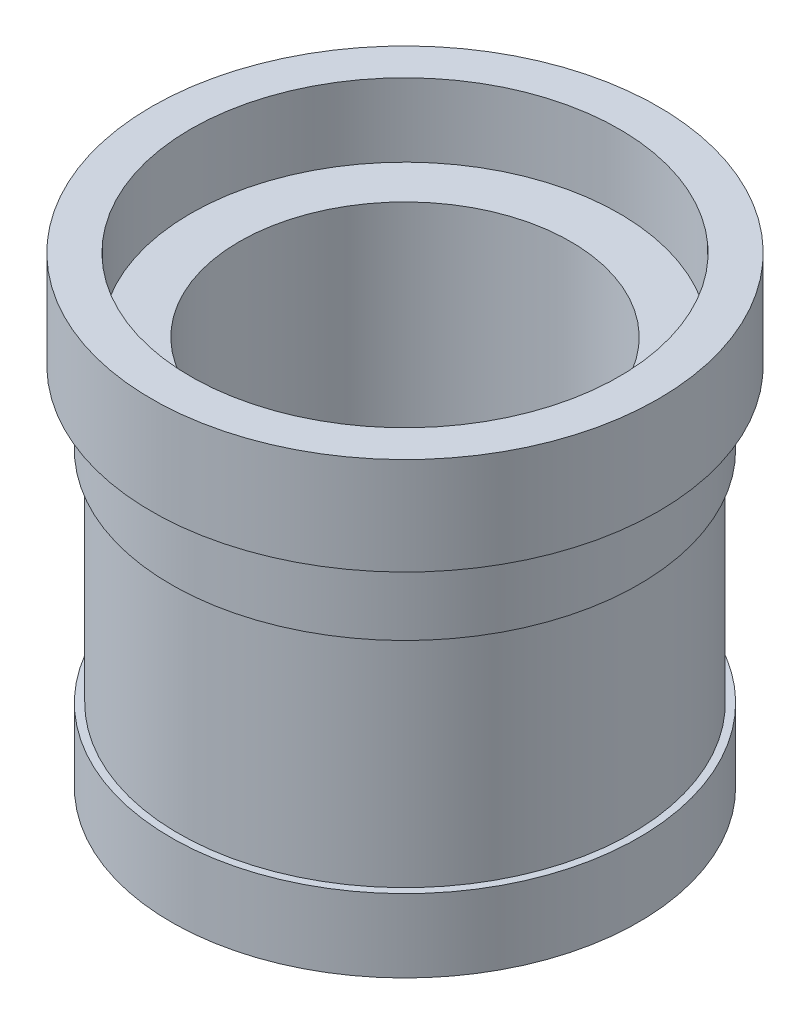
ISO-10303-21;
HEADER;
FILE_DESCRIPTION(('STEP AP214'),'2;1');
FILE_NAME('part.step','',(''),(''),'','','');
FILE_SCHEMA(('AUTOMOTIVE_DESIGN { 1 0 10303 214 1 1 1 1 }'));
ENDSEC;
DATA;
#1=APPLICATION_CONTEXT('core data for automotive mechanical design processes');
#2=APPLICATION_PROTOCOL_DEFINITION('international standard','automotive_design',2000,#1);
#3=PRODUCT_CONTEXT('',#1,'mechanical');
#4=PRODUCT('Part','Part','',(#3));
#5=PRODUCT_RELATED_PRODUCT_CATEGORY('part','',(#4));
#6=PRODUCT_DEFINITION_FORMATION('','',#4);
#7=PRODUCT_DEFINITION_CONTEXT('part definition',#1,'design');
#8=PRODUCT_DEFINITION('design','',#6,#7);
#9=PRODUCT_DEFINITION_SHAPE('','',#8);
#10=(LENGTH_UNIT() NAMED_UNIT(*) SI_UNIT(.MILLI.,.METRE.));
#11=(NAMED_UNIT(*) PLANE_ANGLE_UNIT() SI_UNIT($,.RADIAN.));
#12=(NAMED_UNIT(*) SI_UNIT($,.STERADIAN.) SOLID_ANGLE_UNIT());
#13=UNCERTAINTY_MEASURE_WITH_UNIT(LENGTH_MEASURE(1.E-05),#10,'distance_accuracy_value','');
#14=(GEOMETRIC_REPRESENTATION_CONTEXT(3) GLOBAL_UNCERTAINTY_ASSIGNED_CONTEXT((#13)) GLOBAL_UNIT_ASSIGNED_CONTEXT((#10,
#11,#12)) REPRESENTATION_CONTEXT('',''));
#15=CARTESIAN_POINT('',(0.,0.,0.));
#16=DIRECTION('',(0.,0.,1.));
#17=DIRECTION('',(1.,0.,0.));
#18=AXIS2_PLACEMENT_3D('',#15,#16,#17);
#19=CARTESIAN_POINT('',(0.,74.8007416282434,0.));
#20=DIRECTION('',(0.,1.,0.));
#21=DIRECTION('',(-1.,0.,0.));
#22=AXIS2_PLACEMENT_3D('',#19,#20,#21);
#23=CYLINDRICAL_SURFACE('',#22,34.);
#24=CARTESIAN_POINT('',(0.,0.,0.));
#25=DIRECTION('',(0.,1.,0.));
#26=DIRECTION('',(-1.,0.,0.));
#27=AXIS2_PLACEMENT_3D('',#24,#25,#26);
#28=CIRCLE('',#27,34.);
#29=CARTESIAN_POINT('',(-34.,0.,0.));
#30=VERTEX_POINT('',#29);
#31=EDGE_CURVE('E10',#30,#30,#28,.T.);
#32=ORIENTED_EDGE('',*,*,#31,.F.);
#33=EDGE_LOOP('',(#32));
#34=FACE_BOUND('',#33,.T.);
#35=CARTESIAN_POINT('',(0.,80.,0.));
#36=DIRECTION('',(0.,1.,0.));
#37=DIRECTION('',(-1.,0.,0.));
#38=AXIS2_PLACEMENT_3D('',#35,#36,#37);
#39=CIRCLE('',#38,34.);
#40=CARTESIAN_POINT('',(-34.,80.,0.));
#41=VERTEX_POINT('',#40);
#42=EDGE_CURVE('E88',#41,#41,#39,.T.);
#43=ORIENTED_EDGE('',*,*,#42,.T.);
#44=EDGE_LOOP('',(#43));
#45=FACE_BOUND('',#44,.T.);
#46=ADVANCED_FACE('F37',(#34,#45),#23,.F.);
#47=CARTESIAN_POINT('',(34.,0.,0.));
#48=DIRECTION('',(0.,1.,0.));
#49=DIRECTION('',(-1.,0.,0.));
#50=AXIS2_PLACEMENT_3D('',#47,#48,#49);
#51=PLANE('',#50);
#52=CARTESIAN_POINT('',(0.,0.,0.));
#53=DIRECTION('',(0.,1.,0.));
#54=DIRECTION('',(-1.,0.,0.));
#55=AXIS2_PLACEMENT_3D('',#52,#53,#54);
#56=CIRCLE('',#55,48.);
#57=CARTESIAN_POINT('',(-48.,0.,0.));
#58=VERTEX_POINT('',#57);
#59=EDGE_CURVE('E44',#58,#58,#56,.T.);
#60=ORIENTED_EDGE('',*,*,#59,.F.);
#61=EDGE_LOOP('',(#60));
#62=FACE_BOUND('',#61,.T.);
#63=ORIENTED_EDGE('',*,*,#31,.T.);
#64=EDGE_LOOP('',(#63));
#65=FACE_BOUND('',#64,.T.);
#66=ADVANCED_FACE('F150',(#62,#65),#51,.F.);
#67=CARTESIAN_POINT('',(0.,74.8007416282434,0.));
#68=DIRECTION('',(0.,1.,0.));
#69=DIRECTION('',(-1.,0.,0.));
#70=AXIS2_PLACEMENT_3D('',#67,#68,#69);
#71=CYLINDRICAL_SURFACE('',#70,48.);
#72=CARTESIAN_POINT('',(0.,15.,0.));
#73=DIRECTION('',(0.,1.,0.));
#74=DIRECTION('',(-1.,0.,0.));
#75=AXIS2_PLACEMENT_3D('',#72,#73,#74);
#76=CIRCLE('',#75,48.);
#77=CARTESIAN_POINT('',(-48.,15.,0.));
#78=VERTEX_POINT('',#77);
#79=EDGE_CURVE('E49',#78,#78,#76,.T.);
#80=ORIENTED_EDGE('',*,*,#79,.F.);
#81=EDGE_LOOP('',(#80));
#82=FACE_BOUND('',#81,.T.);
#83=ORIENTED_EDGE('',*,*,#59,.T.);
#84=EDGE_LOOP('',(#83));
#85=FACE_BOUND('',#84,.T.);
#86=ADVANCED_FACE('F145',(#82,#85),#71,.T.);
#87=CARTESIAN_POINT('',(48.,15.,0.));
#88=DIRECTION('',(0.,-1.,0.));
#89=DIRECTION('',(1.,0.,0.));
#90=AXIS2_PLACEMENT_3D('',#87,#88,#89);
#91=PLANE('',#90);
#92=CARTESIAN_POINT('',(0.,15.,0.));
#93=DIRECTION('',(0.,1.,0.));
#94=DIRECTION('',(-1.,0.,0.));
#95=AXIS2_PLACEMENT_3D('',#92,#93,#94);
#96=CIRCLE('',#95,46.5);
#97=CARTESIAN_POINT('',(-46.5,15.,0.));
#98=VERTEX_POINT('',#97);
#99=EDGE_CURVE('E54',#98,#98,#96,.T.);
#100=ORIENTED_EDGE('',*,*,#99,.F.);
#101=EDGE_LOOP('',(#100));
#102=FACE_BOUND('',#101,.T.);
#103=ORIENTED_EDGE('',*,*,#79,.T.);
#104=EDGE_LOOP('',(#103));
#105=FACE_BOUND('',#104,.T.);
#106=ADVANCED_FACE('F139',(#102,#105),#91,.F.);
#107=CARTESIAN_POINT('',(0.,74.8007416282434,0.));
#108=DIRECTION('',(0.,1.,0.));
#109=DIRECTION('',(-1.,0.,0.));
#110=AXIS2_PLACEMENT_3D('',#107,#108,#109);
#111=CYLINDRICAL_SURFACE('',#110,46.5);
#112=CARTESIAN_POINT('',(0.,60.,0.));
#113=DIRECTION('',(0.,1.,0.));
#114=DIRECTION('',(-1.,0.,0.));
#115=AXIS2_PLACEMENT_3D('',#112,#113,#114);
#116=CIRCLE('',#115,46.5);
#117=CARTESIAN_POINT('',(-46.5,60.,0.));
#118=VERTEX_POINT('',#117);
#119=EDGE_CURVE('E60',#118,#118,#116,.T.);
#120=ORIENTED_EDGE('',*,*,#119,.F.);
#121=EDGE_LOOP('',(#120));
#122=FACE_BOUND('',#121,.T.);
#123=ORIENTED_EDGE('',*,*,#99,.T.);
#124=EDGE_LOOP('',(#123));
#125=FACE_BOUND('',#124,.T.);
#126=ADVANCED_FACE('F133',(#122,#125),#111,.T.);
#127=CARTESIAN_POINT('',(46.5,60.,0.));
#128=DIRECTION('',(0.,1.,0.));
#129=DIRECTION('',(-1.,0.,0.));
#130=AXIS2_PLACEMENT_3D('',#127,#128,#129);
#131=PLANE('',#130);
#132=CARTESIAN_POINT('',(0.,60.,0.));
#133=DIRECTION('',(0.,1.,0.));
#134=DIRECTION('',(-1.,0.,0.));
#135=AXIS2_PLACEMENT_3D('',#132,#133,#134);
#136=CIRCLE('',#135,48.);
#137=CARTESIAN_POINT('',(-48.,60.,0.));
#138=VERTEX_POINT('',#137);
#139=EDGE_CURVE('E64',#138,#138,#136,.T.);
#140=ORIENTED_EDGE('',*,*,#139,.F.);
#141=EDGE_LOOP('',(#140));
#142=FACE_BOUND('',#141,.T.);
#143=ORIENTED_EDGE('',*,*,#119,.T.);
#144=EDGE_LOOP('',(#143));
#145=FACE_BOUND('',#144,.T.);
#146=ADVANCED_FACE('F127',(#142,#145),#131,.F.);
#147=CARTESIAN_POINT('',(0.,74.8007416282434,0.));
#148=DIRECTION('',(0.,1.,0.));
#149=DIRECTION('',(-1.,0.,0.));
#150=AXIS2_PLACEMENT_3D('',#147,#148,#149);
#151=CYLINDRICAL_SURFACE('',#150,48.);
#152=CARTESIAN_POINT('',(0.,75.,0.));
#153=DIRECTION('',(0.,1.,0.));
#154=DIRECTION('',(-1.,0.,0.));
#155=AXIS2_PLACEMENT_3D('',#152,#153,#154);
#156=CIRCLE('',#155,48.);
#157=CARTESIAN_POINT('',(-48.,75.,0.));
#158=VERTEX_POINT('',#157);
#159=EDGE_CURVE('E68',#158,#158,#156,.T.);
#160=ORIENTED_EDGE('',*,*,#159,.F.);
#161=EDGE_LOOP('',(#160));
#162=FACE_BOUND('',#161,.T.);
#163=ORIENTED_EDGE('',*,*,#139,.T.);
#164=EDGE_LOOP('',(#163));
#165=FACE_BOUND('',#164,.T.);
#166=ADVANCED_FACE('F121',(#162,#165),#151,.T.);
#167=CARTESIAN_POINT('',(48.,75.,0.));
#168=DIRECTION('',(0.,1.,0.));
#169=DIRECTION('',(-1.,0.,0.));
#170=AXIS2_PLACEMENT_3D('',#167,#168,#169);
#171=PLANE('',#170);
#172=CARTESIAN_POINT('',(0.,75.,0.));
#173=DIRECTION('',(0.,1.,0.));
#174=DIRECTION('',(-1.,0.,0.));
#175=AXIS2_PLACEMENT_3D('',#172,#173,#174);
#176=CIRCLE('',#175,52.);
#177=CARTESIAN_POINT('',(-52.,75.,0.));
#178=VERTEX_POINT('',#177);
#179=EDGE_CURVE('E72',#178,#178,#176,.T.);
#180=ORIENTED_EDGE('',*,*,#179,.F.);
#181=EDGE_LOOP('',(#180));
#182=FACE_BOUND('',#181,.T.);
#183=ORIENTED_EDGE('',*,*,#159,.T.);
#184=EDGE_LOOP('',(#183));
#185=FACE_BOUND('',#184,.T.);
#186=ADVANCED_FACE('F115',(#182,#185),#171,.F.);
#187=CARTESIAN_POINT('',(0.,74.8007416282434,0.));
#188=DIRECTION('',(0.,1.,0.));
#189=DIRECTION('',(-1.,0.,0.));
#190=AXIS2_PLACEMENT_3D('',#187,#188,#189);
#191=CYLINDRICAL_SURFACE('',#190,52.);
#192=CARTESIAN_POINT('',(0.,95.,0.));
#193=DIRECTION('',(0.,1.,0.));
#194=DIRECTION('',(-1.,0.,0.));
#195=AXIS2_PLACEMENT_3D('',#192,#193,#194);
#196=CIRCLE('',#195,52.);
#197=CARTESIAN_POINT('',(-52.,95.,0.));
#198=VERTEX_POINT('',#197);
#199=EDGE_CURVE('E76',#198,#198,#196,.T.);
#200=ORIENTED_EDGE('',*,*,#199,.F.);
#201=EDGE_LOOP('',(#200));
#202=FACE_BOUND('',#201,.T.);
#203=ORIENTED_EDGE('',*,*,#179,.T.);
#204=EDGE_LOOP('',(#203));
#205=FACE_BOUND('',#204,.T.);
#206=ADVANCED_FACE('F109',(#202,#205),#191,.T.);
#207=CARTESIAN_POINT('',(52.,95.,0.));
#208=DIRECTION('',(0.,-1.,0.));
#209=DIRECTION('',(1.,0.,0.));
#210=AXIS2_PLACEMENT_3D('',#207,#208,#209);
#211=PLANE('',#210);
#212=CARTESIAN_POINT('',(0.,95.,0.));
#213=DIRECTION('',(0.,1.,0.));
#214=DIRECTION('',(-1.,0.,0.));
#215=AXIS2_PLACEMENT_3D('',#212,#213,#214);
#216=CIRCLE('',#215,44.);
#217=CARTESIAN_POINT('',(-44.,95.,0.));
#218=VERTEX_POINT('',#217);
#219=EDGE_CURVE('E80',#218,#218,#216,.T.);
#220=ORIENTED_EDGE('',*,*,#219,.F.);
#221=EDGE_LOOP('',(#220));
#222=FACE_BOUND('',#221,.T.);
#223=ORIENTED_EDGE('',*,*,#199,.T.);
#224=EDGE_LOOP('',(#223));
#225=FACE_BOUND('',#224,.T.);
#226=ADVANCED_FACE('F103',(#222,#225),#211,.F.);
#227=CARTESIAN_POINT('',(0.,74.8007416282434,0.));
#228=DIRECTION('',(0.,1.,0.));
#229=DIRECTION('',(-1.,0.,0.));
#230=AXIS2_PLACEMENT_3D('',#227,#228,#229);
#231=CYLINDRICAL_SURFACE('',#230,44.);
#232=CARTESIAN_POINT('',(0.,80.,0.));
#233=DIRECTION('',(0.,1.,0.));
#234=DIRECTION('',(-1.,0.,0.));
#235=AXIS2_PLACEMENT_3D('',#232,#233,#234);
#236=CIRCLE('',#235,44.);
#237=CARTESIAN_POINT('',(-44.,80.,0.));
#238=VERTEX_POINT('',#237);
#239=EDGE_CURVE('E84',#238,#238,#236,.T.);
#240=ORIENTED_EDGE('',*,*,#239,.F.);
#241=EDGE_LOOP('',(#240));
#242=FACE_BOUND('',#241,.T.);
#243=ORIENTED_EDGE('',*,*,#219,.T.);
#244=EDGE_LOOP('',(#243));
#245=FACE_BOUND('',#244,.T.);
#246=ADVANCED_FACE('F97',(#242,#245),#231,.F.);
#247=CARTESIAN_POINT('',(44.,80.,0.));
#248=DIRECTION('',(0.,-1.,0.));
#249=DIRECTION('',(1.,0.,0.));
#250=AXIS2_PLACEMENT_3D('',#247,#248,#249);
#251=PLANE('',#250);
#252=ORIENTED_EDGE('',*,*,#42,.F.);
#253=EDGE_LOOP('',(#252));
#254=FACE_BOUND('',#253,.T.);
#255=ORIENTED_EDGE('',*,*,#239,.T.);
#256=EDGE_LOOP('',(#255));
#257=FACE_BOUND('',#256,.T.);
#258=ADVANCED_FACE('F94',(#254,#257),#251,.F.);
#259=CLOSED_SHELL('',(#46,#66,#86,#106,#126,#146,#166,#186,#206,#226,#246,#258));
#260=MANIFOLD_SOLID_BREP('B2',#259);
#261=ADVANCED_BREP_SHAPE_REPRESENTATION('',(#18,#260),#14);
#262=SHAPE_DEFINITION_REPRESENTATION(#9,#261);
ENDSEC;
END-ISO-10303-21;
